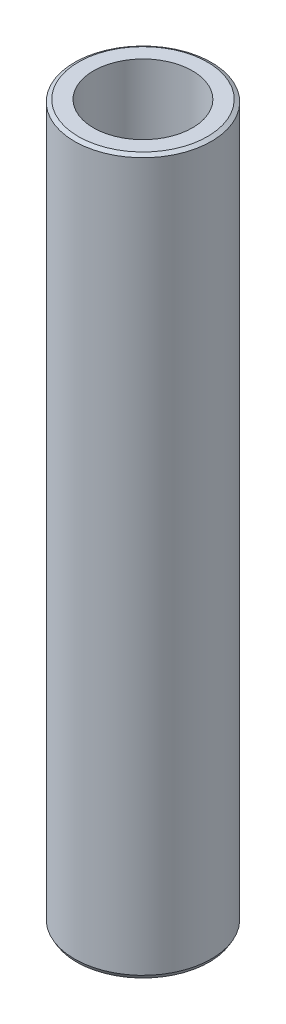
ISO-10303-21;
HEADER;
FILE_DESCRIPTION(('STEP AP214'),'2;1');
FILE_NAME('part.step','',(''),(''),'','','');
FILE_SCHEMA(('AUTOMOTIVE_DESIGN { 1 0 10303 214 1 1 1 1 }'));
ENDSEC;
DATA;
#1=APPLICATION_CONTEXT('core data for automotive mechanical design processes');
#2=APPLICATION_PROTOCOL_DEFINITION('international standard','automotive_design',2000,#1);
#3=PRODUCT_CONTEXT('',#1,'mechanical');
#4=PRODUCT('Part','Part','',(#3));
#5=PRODUCT_RELATED_PRODUCT_CATEGORY('part','',(#4));
#6=PRODUCT_DEFINITION_FORMATION('','',#4);
#7=PRODUCT_DEFINITION_CONTEXT('part definition',#1,'design');
#8=PRODUCT_DEFINITION('design','',#6,#7);
#9=PRODUCT_DEFINITION_SHAPE('','',#8);
#10=(LENGTH_UNIT() NAMED_UNIT(*) SI_UNIT(.MILLI.,.METRE.));
#11=(NAMED_UNIT(*) PLANE_ANGLE_UNIT() SI_UNIT($,.RADIAN.));
#12=(NAMED_UNIT(*) SI_UNIT($,.STERADIAN.) SOLID_ANGLE_UNIT());
#13=UNCERTAINTY_MEASURE_WITH_UNIT(LENGTH_MEASURE(1.E-05),#10,'distance_accuracy_value','');
#14=(GEOMETRIC_REPRESENTATION_CONTEXT(3) GLOBAL_UNCERTAINTY_ASSIGNED_CONTEXT((#13)) GLOBAL_UNIT_ASSIGNED_CONTEXT((#10,
#11,#12)) REPRESENTATION_CONTEXT('',''));
#15=CARTESIAN_POINT('',(0.,0.,0.));
#16=DIRECTION('',(0.,0.,1.));
#17=DIRECTION('',(1.,0.,0.));
#18=AXIS2_PLACEMENT_3D('',#15,#16,#17);
#19=CARTESIAN_POINT('',(0.,600.,0.));
#20=DIRECTION('',(0.,-1.,0.));
#21=DIRECTION('',(0.,0.,-1.));
#22=AXIS2_PLACEMENT_3D('',#19,#20,#21);
#23=CYLINDRICAL_SURFACE('',#22,57.5);
#24=CARTESIAN_POINT('',(0.,598.141617714693,0.));
#25=DIRECTION('',(0.,1.,0.));
#26=DIRECTION('',(0.,0.,1.));
#27=AXIS2_PLACEMENT_3D('',#24,#25,#26);
#28=CIRCLE('',#27,57.5);
#29=CARTESIAN_POINT('',(0.,598.141617714693,57.5));
#30=VERTEX_POINT('',#29);
#31=EDGE_CURVE('E50',#30,#30,#28,.F.);
#32=ORIENTED_EDGE('',*,*,#31,.T.);
#33=EDGE_LOOP('',(#32));
#34=FACE_BOUND('',#33,.T.);
#35=CARTESIAN_POINT('',(0.,3.27337127117655,0.));
#36=DIRECTION('',(0.,1.,0.));
#37=DIRECTION('',(0.,0.,1.));
#38=AXIS2_PLACEMENT_3D('',#35,#36,#37);
#39=CIRCLE('',#38,57.5);
#40=CARTESIAN_POINT('',(0.,3.27337127117655,57.5));
#41=VERTEX_POINT('',#40);
#42=EDGE_CURVE('E51',#41,#41,#39,.T.);
#43=ORIENTED_EDGE('',*,*,#42,.T.);
#44=EDGE_LOOP('',(#43));
#45=FACE_BOUND('',#44,.T.);
#46=ADVANCED_FACE('F39',(#34,#45),#23,.T.);
#47=CARTESIAN_POINT('',(0.,600.,0.));
#48=DIRECTION('',(0.,1.,0.));
#49=DIRECTION('',(0.,0.,1.));
#50=AXIS2_PLACEMENT_3D('',#47,#48,#49);
#51=PLANE('',#50);
#52=CARTESIAN_POINT('',(0.,600.,0.));
#53=DIRECTION('',(0.,1.,0.));
#54=DIRECTION('',(0.,0.,1.));
#55=AXIS2_PLACEMENT_3D('',#52,#53,#54);
#56=CIRCLE('',#55,54.2266287288232);
#57=CARTESIAN_POINT('',(0.,600.,54.2266287288232));
#58=VERTEX_POINT('',#57);
#59=EDGE_CURVE('E54',#58,#58,#56,.T.);
#60=ORIENTED_EDGE('',*,*,#59,.T.);
#61=EDGE_LOOP('',(#60));
#62=FACE_BOUND('',#61,.T.);
#63=CARTESIAN_POINT('',(0.,600.,0.));
#64=DIRECTION('',(0.,1.,0.));
#65=DIRECTION('',(0.,0.,1.));
#66=AXIS2_PLACEMENT_3D('',#63,#64,#65);
#67=CIRCLE('',#66,41.5540284884404);
#68=CARTESIAN_POINT('',(0.,600.,41.5540284884404));
#69=VERTEX_POINT('',#68);
#70=EDGE_CURVE('E58',#69,#69,#67,.T.);
#71=ORIENTED_EDGE('',*,*,#70,.F.);
#72=EDGE_LOOP('',(#71));
#73=FACE_BOUND('',#72,.T.);
#74=ADVANCED_FACE('F69',(#62,#73),#51,.T.);
#75=CARTESIAN_POINT('',(0.,0.,0.));
#76=DIRECTION('',(0.,1.,0.));
#77=DIRECTION('',(0.,0.,1.));
#78=AXIS2_PLACEMENT_3D('',#75,#76,#77);
#79=PLANE('',#78);
#80=CARTESIAN_POINT('',(0.,0.,0.));
#81=DIRECTION('',(0.,1.,0.));
#82=DIRECTION('',(0.,0.,1.));
#83=AXIS2_PLACEMENT_3D('',#80,#81,#82);
#84=CIRCLE('',#83,55.641617714693);
#85=CARTESIAN_POINT('',(0.,0.,55.641617714693));
#86=VERTEX_POINT('',#85);
#87=EDGE_CURVE('E10',#86,#86,#84,.F.);
#88=ORIENTED_EDGE('',*,*,#87,.T.);
#89=EDGE_LOOP('',(#88));
#90=FACE_BOUND('',#89,.T.);
#91=CARTESIAN_POINT('',(0.,0.,0.));
#92=DIRECTION('',(0.,1.,0.));
#93=DIRECTION('',(0.,0.,1.));
#94=AXIS2_PLACEMENT_3D('',#91,#92,#93);
#95=CIRCLE('',#94,41.5540284884404);
#96=CARTESIAN_POINT('',(0.,0.,41.5540284884404));
#97=VERTEX_POINT('',#96);
#98=EDGE_CURVE('E63',#97,#97,#95,.T.);
#99=ORIENTED_EDGE('',*,*,#98,.T.);
#100=EDGE_LOOP('',(#99));
#101=FACE_BOUND('',#100,.T.);
#102=ADVANCED_FACE('F75',(#90,#101),#79,.F.);
#103=CARTESIAN_POINT('',(0.,600.,0.));
#104=DIRECTION('',(0.,-1.,0.));
#105=DIRECTION('',(0.,0.,-1.));
#106=AXIS2_PLACEMENT_3D('',#103,#104,#105);
#107=CYLINDRICAL_SURFACE('',#106,41.5540284884404);
#108=ORIENTED_EDGE('',*,*,#70,.T.);
#109=EDGE_LOOP('',(#108));
#110=FACE_BOUND('',#109,.T.);
#111=ORIENTED_EDGE('',*,*,#98,.F.);
#112=EDGE_LOOP('',(#111));
#113=FACE_BOUND('',#112,.T.);
#114=ADVANCED_FACE('F70',(#110,#113),#107,.F.);
#115=CARTESIAN_POINT('',(0.,600.,0.));
#116=DIRECTION('',(0.,-1.,0.));
#117=DIRECTION('',(0.,0.,-1.));
#118=AXIS2_PLACEMENT_3D('',#115,#116,#117);
#119=CONICAL_SURFACE('',#118,54.2266287288232,1.05444483834171);
#120=ORIENTED_EDGE('',*,*,#31,.F.);
#121=EDGE_LOOP('',(#120));
#122=FACE_BOUND('',#121,.T.);
#123=ORIENTED_EDGE('',*,*,#59,.F.);
#124=EDGE_LOOP('',(#123));
#125=FACE_BOUND('',#124,.T.);
#126=ADVANCED_FACE('F81',(#122,#125),#119,.T.);
#127=CARTESIAN_POINT('',(0.,3.27337127117655,0.));
#128=DIRECTION('',(0.,1.,0.));
#129=DIRECTION('',(0.,0.,1.));
#130=AXIS2_PLACEMENT_3D('',#127,#128,#129);
#131=CONICAL_SURFACE('',#130,57.5,0.51635148845319);
#132=ORIENTED_EDGE('',*,*,#87,.F.);
#133=EDGE_LOOP('',(#132));
#134=FACE_BOUND('',#133,.T.);
#135=ORIENTED_EDGE('',*,*,#42,.F.);
#136=EDGE_LOOP('',(#135));
#137=FACE_BOUND('',#136,.T.);
#138=ADVANCED_FACE('F45',(#134,#137),#131,.T.);
#139=CLOSED_SHELL('',(#46,#74,#102,#114,#126,#138));
#140=MANIFOLD_SOLID_BREP('B2',#139);
#141=ADVANCED_BREP_SHAPE_REPRESENTATION('',(#18,#140),#14);
#142=SHAPE_DEFINITION_REPRESENTATION(#9,#141);
ENDSEC;
END-ISO-10303-21;
